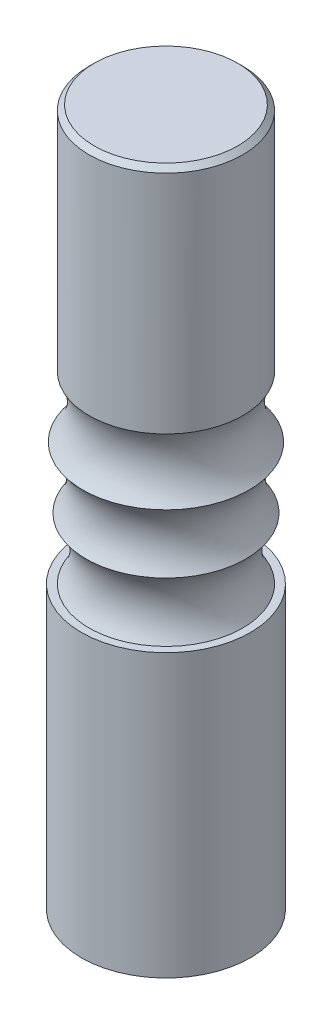
ISO-10303-21;
HEADER;
FILE_DESCRIPTION(('STEP AP214'),'2;1');
FILE_NAME('part.step','',(''),(''),'','','');
FILE_SCHEMA(('AUTOMOTIVE_DESIGN { 1 0 10303 214 1 1 1 1 }'));
ENDSEC;
DATA;
#1=APPLICATION_CONTEXT('core data for automotive mechanical design processes');
#2=APPLICATION_PROTOCOL_DEFINITION('international standard','automotive_design',2000,#1);
#3=PRODUCT_CONTEXT('',#1,'mechanical');
#4=PRODUCT('Part','Part','',(#3));
#5=PRODUCT_RELATED_PRODUCT_CATEGORY('part','',(#4));
#6=PRODUCT_DEFINITION_FORMATION('','',#4);
#7=PRODUCT_DEFINITION_CONTEXT('part definition',#1,'design');
#8=PRODUCT_DEFINITION('design','',#6,#7);
#9=PRODUCT_DEFINITION_SHAPE('','',#8);
#10=(LENGTH_UNIT() NAMED_UNIT(*) SI_UNIT(.MILLI.,.METRE.));
#11=(NAMED_UNIT(*) PLANE_ANGLE_UNIT() SI_UNIT($,.RADIAN.));
#12=(NAMED_UNIT(*) SI_UNIT($,.STERADIAN.) SOLID_ANGLE_UNIT());
#13=UNCERTAINTY_MEASURE_WITH_UNIT(LENGTH_MEASURE(1.E-05),#10,'distance_accuracy_value','');
#14=(GEOMETRIC_REPRESENTATION_CONTEXT(3) GLOBAL_UNCERTAINTY_ASSIGNED_CONTEXT((#13)) GLOBAL_UNIT_ASSIGNED_CONTEXT((#10,
#11,#12)) REPRESENTATION_CONTEXT('',''));
#15=CARTESIAN_POINT('',(0.,0.,0.));
#16=DIRECTION('',(0.,0.,1.));
#17=DIRECTION('',(1.,0.,0.));
#18=AXIS2_PLACEMENT_3D('',#15,#16,#17);
#19=CARTESIAN_POINT('',(0.,55.,0.));
#20=DIRECTION('',(0.,-1.,0.));
#21=DIRECTION('',(0.,0.,-1.));
#22=AXIS2_PLACEMENT_3D('',#19,#20,#21);
#23=CYLINDRICAL_SURFACE('',#22,16.5);
#24=CARTESIAN_POINT('',(0.,55.,0.));
#25=DIRECTION('',(0.,1.,0.));
#26=DIRECTION('',(0.,0.,1.));
#27=AXIS2_PLACEMENT_3D('',#24,#25,#26);
#28=CIRCLE('',#27,16.5);
#29=CARTESIAN_POINT('',(0.,55.,16.5));
#30=VERTEX_POINT('',#29);
#31=EDGE_CURVE('E46',#30,#30,#28,.T.);
#32=ORIENTED_EDGE('',*,*,#31,.F.);
#33=EDGE_LOOP('',(#32));
#34=FACE_BOUND('',#33,.T.);
#35=CARTESIAN_POINT('',(0.,0.,0.));
#36=DIRECTION('',(0.,1.,0.));
#37=DIRECTION('',(0.,0.,1.));
#38=AXIS2_PLACEMENT_3D('',#35,#36,#37);
#39=CIRCLE('',#38,16.5);
#40=CARTESIAN_POINT('',(0.,0.,16.5));
#41=VERTEX_POINT('',#40);
#42=EDGE_CURVE('E49',#41,#41,#39,.T.);
#43=ORIENTED_EDGE('',*,*,#42,.T.);
#44=EDGE_LOOP('',(#43));
#45=FACE_BOUND('',#44,.T.);
#46=ADVANCED_FACE('F31',(#34,#45),#23,.T.);
#47=CARTESIAN_POINT('',(0.,55.,0.));
#48=DIRECTION('',(0.,1.,0.));
#49=DIRECTION('',(0.,0.,1.));
#50=AXIS2_PLACEMENT_3D('',#47,#48,#49);
#51=PLANE('',#50);
#52=CARTESIAN_POINT('',(0.,55.,0.));
#53=DIRECTION('',(0.,-1.,0.));
#54=DIRECTION('',(0.,0.,-1.));
#55=AXIS2_PLACEMENT_3D('',#52,#53,#54);
#56=CIRCLE('',#55,15.);
#57=CARTESIAN_POINT('',(0.,55.,-15.));
#58=VERTEX_POINT('',#57);
#59=EDGE_CURVE('E42',#58,#58,#56,.F.);
#60=ORIENTED_EDGE('',*,*,#59,.F.);
#61=EDGE_LOOP('',(#60));
#62=FACE_BOUND('',#61,.T.);
#63=ORIENTED_EDGE('',*,*,#31,.T.);
#64=EDGE_LOOP('',(#63));
#65=FACE_BOUND('',#64,.T.);
#66=ADVANCED_FACE('F81',(#62,#65),#51,.T.);
#67=CARTESIAN_POINT('',(0.,0.,0.));
#68=DIRECTION('',(0.,1.,0.));
#69=DIRECTION('',(0.,0.,1.));
#70=AXIS2_PLACEMENT_3D('',#67,#68,#69);
#71=PLANE('',#70);
#72=ORIENTED_EDGE('',*,*,#42,.F.);
#73=EDGE_LOOP('',(#72));
#74=FACE_BOUND('',#73,.T.);
#75=ADVANCED_FACE('F86',(#74),#71,.F.);
#76=CARTESIAN_POINT('',(15.,136.,0.));
#77=DIRECTION('',(0.,1.,0.));
#78=DIRECTION('',(0.,0.,1.));
#79=AXIS2_PLACEMENT_3D('',#76,#77,#78);
#80=PLANE('',#79);
#81=CARTESIAN_POINT('',(0.,136.,0.));
#82=DIRECTION('',(0.,1.,0.));
#83=DIRECTION('',(0.,0.,1.));
#84=AXIS2_PLACEMENT_3D('',#81,#82,#83);
#85=CIRCLE('',#84,14.);
#86=CARTESIAN_POINT('',(0.,136.,14.));
#87=VERTEX_POINT('',#86);
#88=EDGE_CURVE('E10',#87,#87,#85,.T.);
#89=ORIENTED_EDGE('',*,*,#88,.T.);
#90=EDGE_LOOP('',(#89));
#91=FACE_BOUND('',#90,.T.);
#92=ADVANCED_FACE('F93',(#91),#80,.T.);
#93=CARTESIAN_POINT('',(0.,55.,0.));
#94=DIRECTION('',(0.,-1.,0.));
#95=DIRECTION('',(0.,0.,-1.));
#96=AXIS2_PLACEMENT_3D('',#93,#94,#95);
#97=CYLINDRICAL_SURFACE('',#96,15.);
#98=CARTESIAN_POINT('',(0.,135.,0.));
#99=DIRECTION('',(0.,1.,0.));
#100=DIRECTION('',(0.,0.,1.));
#101=AXIS2_PLACEMENT_3D('',#98,#99,#100);
#102=CIRCLE('',#101,15.);
#103=CARTESIAN_POINT('',(0.,135.,15.));
#104=VERTEX_POINT('',#103);
#105=EDGE_CURVE('E38',#104,#104,#102,.F.);
#106=ORIENTED_EDGE('',*,*,#105,.T.);
#107=EDGE_LOOP('',(#106));
#108=FACE_BOUND('',#107,.T.);
#109=CARTESIAN_POINT('',(0.,90.9024284426457,0.));
#110=DIRECTION('',(0.,-1.,0.));
#111=DIRECTION('',(0.,0.,-1.));
#112=AXIS2_PLACEMENT_3D('',#109,#110,#111);
#113=CIRCLE('',#112,15.);
#114=CARTESIAN_POINT('',(0.,90.9024284426457,-15.));
#115=VERTEX_POINT('',#114);
#116=EDGE_CURVE('E52',#115,#115,#113,.T.);
#117=ORIENTED_EDGE('',*,*,#116,.F.);
#118=EDGE_LOOP('',(#117));
#119=FACE_BOUND('',#118,.T.);
#120=ADVANCED_FACE('F77',(#108,#119),#97,.T.);
#121=CARTESIAN_POINT('',(0.,85.7670320298789,0.));
#122=DIRECTION('',(0.,-1.,0.));
#123=DIRECTION('',(0.,0.,-1.));
#124=AXIS2_PLACEMENT_3D('',#121,#122,#123);
#125=TOROIDAL_SURFACE('',#124,23.5806586975443,10.);
#126=ORIENTED_EDGE('',*,*,#116,.T.);
#127=EDGE_LOOP('',(#126));
#128=FACE_BOUND('',#127,.T.);
#129=CARTESIAN_POINT('',(0.,78.9675106758111,0.));
#130=DIRECTION('',(0.,-1.,0.));
#131=DIRECTION('',(0.,0.,-1.));
#132=AXIS2_PLACEMENT_3D('',#129,#130,#131);
#133=CIRCLE('',#132,16.2480937059757);
#134=CARTESIAN_POINT('',(0.,78.9675106758111,-16.2480937059757));
#135=VERTEX_POINT('',#134);
#136=EDGE_CURVE('E57',#135,#135,#133,.T.);
#137=ORIENTED_EDGE('',*,*,#136,.F.);
#138=EDGE_LOOP('',(#137));
#139=FACE_BOUND('',#138,.T.);
#140=ADVANCED_FACE('F69',(#128,#139),#125,.F.);
#141=CARTESIAN_POINT('',(0.,72.6,0.));
#142=DIRECTION('',(0.,-1.,0.));
#143=DIRECTION('',(0.,0.,-1.));
#144=AXIS2_PLACEMENT_3D('',#141,#142,#143);
#145=TOROIDAL_SURFACE('',#144,23.,9.28080981433483);
#146=ORIENTED_EDGE('',*,*,#136,.T.);
#147=EDGE_LOOP('',(#146));
#148=FACE_BOUND('',#147,.T.);
#149=CARTESIAN_POINT('',(0.,66.9844403829228,0.));
#150=DIRECTION('',(0.,-1.,0.));
#151=DIRECTION('',(0.,0.,-1.));
#152=AXIS2_PLACEMENT_3D('',#149,#150,#151);
#153=CIRCLE('',#152,15.6108917319541);
#154=CARTESIAN_POINT('',(0.,66.9844403829228,-15.6108917319541));
#155=VERTEX_POINT('',#154);
#156=EDGE_CURVE('E60',#155,#155,#153,.T.);
#157=ORIENTED_EDGE('',*,*,#156,.F.);
#158=EDGE_LOOP('',(#157));
#159=FACE_BOUND('',#158,.T.);
#160=ADVANCED_FACE('F67',(#148,#159),#145,.F.);
#161=CARTESIAN_POINT('',(0.,60.6,0.));
#162=DIRECTION('',(0.,-1.,0.));
#163=DIRECTION('',(0.,0.,-1.));
#164=AXIS2_PLACEMENT_3D('',#161,#162,#163);
#165=TOROIDAL_SURFACE('',#164,23.,9.76524449258697);
#166=ORIENTED_EDGE('',*,*,#156,.T.);
#167=EDGE_LOOP('',(#166));
#168=FACE_BOUND('',#167,.T.);
#169=ORIENTED_EDGE('',*,*,#59,.T.);
#170=EDGE_LOOP('',(#169));
#171=FACE_BOUND('',#170,.T.);
#172=ADVANCED_FACE('F64',(#168,#171),#165,.F.);
#173=CARTESIAN_POINT('',(0.,135.,0.));
#174=DIRECTION('',(0.,-1.,0.));
#175=DIRECTION('',(0.,0.,-1.));
#176=AXIS2_PLACEMENT_3D('',#173,#174,#175);
#177=CONICAL_SURFACE('',#176,15.,0.785398163397454);
#178=ORIENTED_EDGE('',*,*,#88,.F.);
#179=EDGE_LOOP('',(#178));
#180=FACE_BOUND('',#179,.T.);
#181=ORIENTED_EDGE('',*,*,#105,.F.);
#182=EDGE_LOOP('',(#181));
#183=FACE_BOUND('',#182,.T.);
#184=ADVANCED_FACE('F33',(#180,#183),#177,.T.);
#185=CLOSED_SHELL('',(#46,#66,#75,#92,#120,#140,#160,#172,#184));
#186=MANIFOLD_SOLID_BREP('B2',#185);
#187=ADVANCED_BREP_SHAPE_REPRESENTATION('',(#18,#186),#14);
#188=SHAPE_DEFINITION_REPRESENTATION(#9,#187);
ENDSEC;
END-ISO-10303-21;
